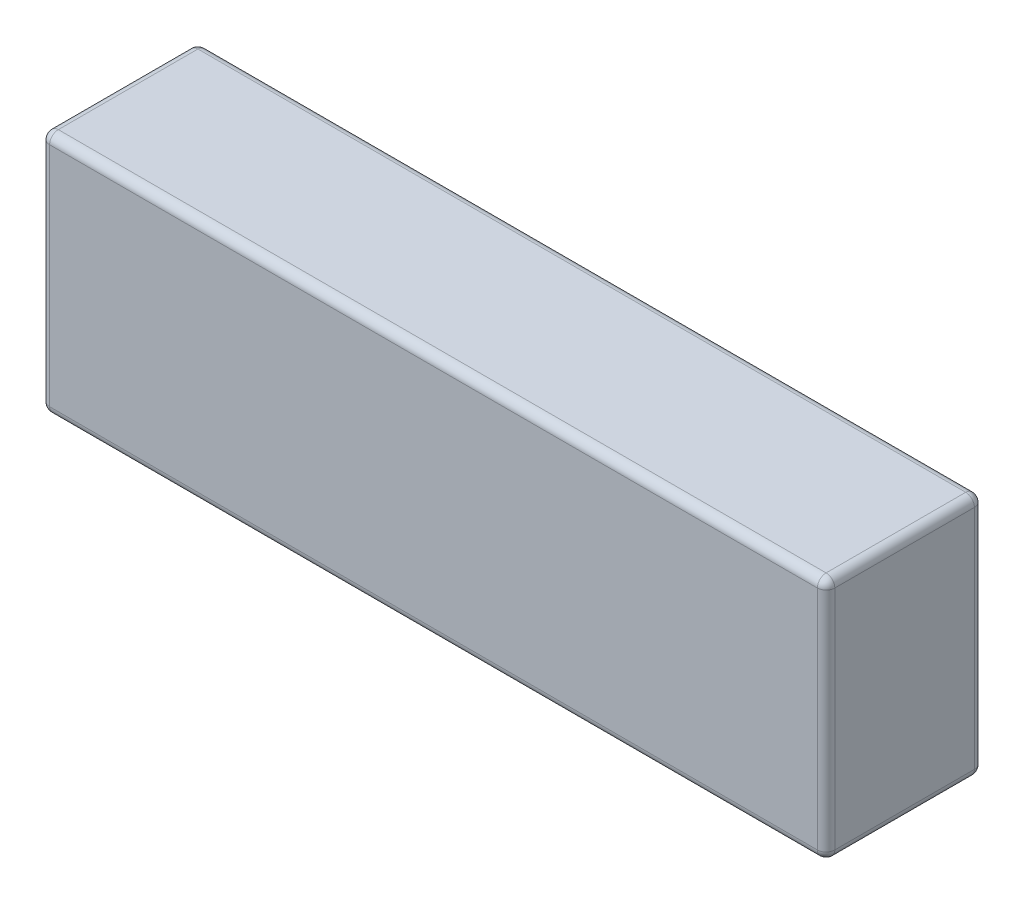
ISO-10303-21;
HEADER;
FILE_DESCRIPTION(('STEP AP214'),'2;1');
FILE_NAME('part.step','',(''),(''),'','','');
FILE_SCHEMA(('AUTOMOTIVE_DESIGN { 1 0 10303 214 1 1 1 1 }'));
ENDSEC;
DATA;
#1=APPLICATION_CONTEXT('core data for automotive mechanical design processes');
#2=APPLICATION_PROTOCOL_DEFINITION('international standard','automotive_design',2000,#1);
#3=PRODUCT_CONTEXT('',#1,'mechanical');
#4=PRODUCT('Part','Part','',(#3));
#5=PRODUCT_RELATED_PRODUCT_CATEGORY('part','',(#4));
#6=PRODUCT_DEFINITION_FORMATION('','',#4);
#7=PRODUCT_DEFINITION_CONTEXT('part definition',#1,'design');
#8=PRODUCT_DEFINITION('design','',#6,#7);
#9=PRODUCT_DEFINITION_SHAPE('','',#8);
#10=(LENGTH_UNIT() NAMED_UNIT(*) SI_UNIT(.MILLI.,.METRE.));
#11=(NAMED_UNIT(*) PLANE_ANGLE_UNIT() SI_UNIT($,.RADIAN.));
#12=(NAMED_UNIT(*) SI_UNIT($,.STERADIAN.) SOLID_ANGLE_UNIT());
#13=UNCERTAINTY_MEASURE_WITH_UNIT(LENGTH_MEASURE(1.E-05),#10,'distance_accuracy_value','');
#14=(GEOMETRIC_REPRESENTATION_CONTEXT(3) GLOBAL_UNCERTAINTY_ASSIGNED_CONTEXT((#13)) GLOBAL_UNIT_ASSIGNED_CONTEXT((#10,
#11,#12)) REPRESENTATION_CONTEXT('',''));
#15=CARTESIAN_POINT('',(0.,0.,0.));
#16=DIRECTION('',(0.,0.,1.));
#17=DIRECTION('',(1.,0.,0.));
#18=AXIS2_PLACEMENT_3D('',#15,#16,#17);
#19=CARTESIAN_POINT('',(-45.,28.,-9.));
#20=DIRECTION('',(1.,0.,0.));
#21=DIRECTION('',(0.,0.,-1.));
#22=AXIS2_PLACEMENT_3D('',#19,#20,#21);
#23=PLANE('',#22);
#24=DIRECTION('',(0.,0.,1.));
#25=VECTOR('',#24,1.);
#26=CARTESIAN_POINT('',(-45.,27.,-9.));
#27=LINE('',#26,#25);
#28=CARTESIAN_POINT('',(-45.,27.,8.));
#29=VERTEX_POINT('',#28);
#30=CARTESIAN_POINT('',(-45.,27.,-8.));
#31=VERTEX_POINT('',#30);
#32=EDGE_CURVE('E152',#29,#31,#27,.F.);
#33=ORIENTED_EDGE('',*,*,#32,.T.);
#34=DIRECTION('',(0.,-1.,0.));
#35=VECTOR('',#34,1.);
#36=CARTESIAN_POINT('',(-45.,28.,-8.));
#37=LINE('',#36,#35);
#38=CARTESIAN_POINT('',(-45.,1.,-8.));
#39=VERTEX_POINT('',#38);
#40=EDGE_CURVE('E155',#31,#39,#37,.T.);
#41=ORIENTED_EDGE('',*,*,#40,.T.);
#42=DIRECTION('',(0.,0.,1.));
#43=VECTOR('',#42,1.);
#44=CARTESIAN_POINT('',(-45.,1.,-9.));
#45=LINE('',#44,#43);
#46=CARTESIAN_POINT('',(-45.,1.,8.));
#47=VERTEX_POINT('',#46);
#48=EDGE_CURVE('E128',#39,#47,#45,.T.);
#49=ORIENTED_EDGE('',*,*,#48,.T.);
#50=DIRECTION('',(0.,-1.,0.));
#51=VECTOR('',#50,1.);
#52=CARTESIAN_POINT('',(-45.,28.,8.));
#53=LINE('',#52,#51);
#54=EDGE_CURVE('E146',#47,#29,#53,.F.);
#55=ORIENTED_EDGE('',*,*,#54,.T.);
#56=EDGE_LOOP('',(#33,#41,#49,#55));
#57=FACE_BOUND('',#56,.T.);
#58=ADVANCED_FACE('F34',(#57),#23,.F.);
#59=CARTESIAN_POINT('',(-45.,28.,9.));
#60=DIRECTION('',(0.,0.,-1.));
#61=DIRECTION('',(-1.,0.,0.));
#62=AXIS2_PLACEMENT_3D('',#59,#60,#61);
#63=PLANE('',#62);
#64=DIRECTION('',(1.,0.,0.));
#65=VECTOR('',#64,1.);
#66=CARTESIAN_POINT('',(-45.,27.,9.));
#67=LINE('',#66,#65);
#68=CARTESIAN_POINT('',(44.,27.,9.));
#69=VERTEX_POINT('',#68);
#70=CARTESIAN_POINT('',(-44.,27.,9.));
#71=VERTEX_POINT('',#70);
#72=EDGE_CURVE('E43',#69,#71,#67,.F.);
#73=ORIENTED_EDGE('',*,*,#72,.T.);
#74=DIRECTION('',(0.,-1.,0.));
#75=VECTOR('',#74,1.);
#76=CARTESIAN_POINT('',(-44.,28.,9.));
#77=LINE('',#76,#75);
#78=CARTESIAN_POINT('',(-44.,1.,9.));
#79=VERTEX_POINT('',#78);
#80=EDGE_CURVE('E11',#71,#79,#77,.T.);
#81=ORIENTED_EDGE('',*,*,#80,.T.);
#82=DIRECTION('',(1.,0.,0.));
#83=VECTOR('',#82,1.);
#84=CARTESIAN_POINT('',(-45.,1.,9.));
#85=LINE('',#84,#83);
#86=CARTESIAN_POINT('',(44.,1.,9.));
#87=VERTEX_POINT('',#86);
#88=EDGE_CURVE('E195',#79,#87,#85,.T.);
#89=ORIENTED_EDGE('',*,*,#88,.T.);
#90=DIRECTION('',(0.,-1.,0.));
#91=VECTOR('',#90,1.);
#92=CARTESIAN_POINT('',(44.,28.,9.));
#93=LINE('',#92,#91);
#94=EDGE_CURVE('E54',#87,#69,#93,.F.);
#95=ORIENTED_EDGE('',*,*,#94,.T.);
#96=EDGE_LOOP('',(#73,#81,#89,#95));
#97=FACE_BOUND('',#96,.T.);
#98=ADVANCED_FACE('F327',(#97),#63,.F.);
#99=CARTESIAN_POINT('',(45.,28.,-9.));
#100=DIRECTION('',(-1.,0.,0.));
#101=DIRECTION('',(0.,0.,1.));
#102=AXIS2_PLACEMENT_3D('',#99,#100,#101);
#103=PLANE('',#102);
#104=DIRECTION('',(0.,0.,-1.));
#105=VECTOR('',#104,1.);
#106=CARTESIAN_POINT('',(45.,1.,-9.));
#107=LINE('',#106,#105);
#108=CARTESIAN_POINT('',(45.,1.,8.));
#109=VERTEX_POINT('',#108);
#110=CARTESIAN_POINT('',(45.,1.,-8.));
#111=VERTEX_POINT('',#110);
#112=EDGE_CURVE('E172',#109,#111,#107,.T.);
#113=ORIENTED_EDGE('',*,*,#112,.T.);
#114=DIRECTION('',(0.,-1.,0.));
#115=VECTOR('',#114,1.);
#116=CARTESIAN_POINT('',(45.,28.,-8.));
#117=LINE('',#116,#115);
#118=CARTESIAN_POINT('',(45.,27.,-8.));
#119=VERTEX_POINT('',#118);
#120=EDGE_CURVE('E175',#111,#119,#117,.F.);
#121=ORIENTED_EDGE('',*,*,#120,.T.);
#122=DIRECTION('',(0.,0.,-1.));
#123=VECTOR('',#122,1.);
#124=CARTESIAN_POINT('',(45.,27.,9.));
#125=LINE('',#124,#123);
#126=CARTESIAN_POINT('',(45.,27.,8.));
#127=VERTEX_POINT('',#126);
#128=EDGE_CURVE('E170',#119,#127,#125,.F.);
#129=ORIENTED_EDGE('',*,*,#128,.T.);
#130=DIRECTION('',(0.,-1.,0.));
#131=VECTOR('',#130,1.);
#132=CARTESIAN_POINT('',(45.,28.,8.));
#133=LINE('',#132,#131);
#134=EDGE_CURVE('E168',#127,#109,#133,.T.);
#135=ORIENTED_EDGE('',*,*,#134,.T.);
#136=EDGE_LOOP('',(#113,#121,#129,#135));
#137=FACE_BOUND('',#136,.T.);
#138=ADVANCED_FACE('F296',(#137),#103,.F.);
#139=CARTESIAN_POINT('',(-45.,28.,-9.));
#140=DIRECTION('',(0.,0.,1.));
#141=DIRECTION('',(1.,0.,0.));
#142=AXIS2_PLACEMENT_3D('',#139,#140,#141);
#143=PLANE('',#142);
#144=DIRECTION('',(-1.,0.,0.));
#145=VECTOR('',#144,1.);
#146=CARTESIAN_POINT('',(45.,27.,-9.));
#147=LINE('',#146,#145);
#148=CARTESIAN_POINT('',(-44.,27.,-9.));
#149=VERTEX_POINT('',#148);
#150=CARTESIAN_POINT('',(44.,27.,-9.));
#151=VERTEX_POINT('',#150);
#152=EDGE_CURVE('E190',#149,#151,#147,.F.);
#153=ORIENTED_EDGE('',*,*,#152,.T.);
#154=DIRECTION('',(0.,-1.,0.));
#155=VECTOR('',#154,1.);
#156=CARTESIAN_POINT('',(44.,28.,-9.));
#157=LINE('',#156,#155);
#158=CARTESIAN_POINT('',(44.,1.,-9.));
#159=VERTEX_POINT('',#158);
#160=EDGE_CURVE('E192',#151,#159,#157,.T.);
#161=ORIENTED_EDGE('',*,*,#160,.T.);
#162=DIRECTION('',(-1.,0.,0.));
#163=VECTOR('',#162,1.);
#164=CARTESIAN_POINT('',(-45.,1.,-9.));
#165=LINE('',#164,#163);
#166=CARTESIAN_POINT('',(-44.,1.,-9.));
#167=VERTEX_POINT('',#166);
#168=EDGE_CURVE('E186',#159,#167,#165,.T.);
#169=ORIENTED_EDGE('',*,*,#168,.T.);
#170=DIRECTION('',(0.,-1.,0.));
#171=VECTOR('',#170,1.);
#172=CARTESIAN_POINT('',(-44.,28.,-9.));
#173=LINE('',#172,#171);
#174=EDGE_CURVE('E188',#167,#149,#173,.F.);
#175=ORIENTED_EDGE('',*,*,#174,.T.);
#176=EDGE_LOOP('',(#153,#161,#169,#175));
#177=FACE_BOUND('',#176,.T.);
#178=ADVANCED_FACE('F270',(#177),#143,.F.);
#179=CARTESIAN_POINT('',(0.,28.,0.));
#180=DIRECTION('',(0.,1.,0.));
#181=DIRECTION('',(0.,0.,1.));
#182=AXIS2_PLACEMENT_3D('',#179,#180,#181);
#183=PLANE('',#182);
#184=DIRECTION('',(0.,0.,-1.));
#185=VECTOR('',#184,1.);
#186=CARTESIAN_POINT('',(44.,28.,-9.));
#187=LINE('',#186,#185);
#188=CARTESIAN_POINT('',(44.,28.,8.));
#189=VERTEX_POINT('',#188);
#190=CARTESIAN_POINT('',(44.,28.,-8.));
#191=VERTEX_POINT('',#190);
#192=EDGE_CURVE('E181',#189,#191,#187,.T.);
#193=ORIENTED_EDGE('',*,*,#192,.T.);
#194=DIRECTION('',(-1.,0.,0.));
#195=VECTOR('',#194,1.);
#196=CARTESIAN_POINT('',(-45.,28.,-8.));
#197=LINE('',#196,#195);
#198=CARTESIAN_POINT('',(-44.,28.,-8.));
#199=VERTEX_POINT('',#198);
#200=EDGE_CURVE('E184',#191,#199,#197,.T.);
#201=ORIENTED_EDGE('',*,*,#200,.T.);
#202=DIRECTION('',(0.,0.,1.));
#203=VECTOR('',#202,1.);
#204=CARTESIAN_POINT('',(-44.,28.,9.));
#205=LINE('',#204,#203);
#206=CARTESIAN_POINT('',(-44.,28.,8.));
#207=VERTEX_POINT('',#206);
#208=EDGE_CURVE('E179',#199,#207,#205,.T.);
#209=ORIENTED_EDGE('',*,*,#208,.T.);
#210=DIRECTION('',(1.,0.,0.));
#211=VECTOR('',#210,1.);
#212=CARTESIAN_POINT('',(45.,28.,8.));
#213=LINE('',#212,#211);
#214=EDGE_CURVE('E177',#207,#189,#213,.T.);
#215=ORIENTED_EDGE('',*,*,#214,.T.);
#216=EDGE_LOOP('',(#193,#201,#209,#215));
#217=FACE_BOUND('',#216,.T.);
#218=ADVANCED_FACE('F278',(#217),#183,.T.);
#219=CARTESIAN_POINT('',(0.,0.,0.));
#220=DIRECTION('',(0.,1.,0.));
#221=DIRECTION('',(0.,0.,1.));
#222=AXIS2_PLACEMENT_3D('',#219,#220,#221);
#223=PLANE('',#222);
#224=DIRECTION('',(0.,0.,1.));
#225=VECTOR('',#224,1.);
#226=CARTESIAN_POINT('',(-44.,0.,0.));
#227=LINE('',#226,#225);
#228=CARTESIAN_POINT('',(-44.,0.,8.));
#229=VERTEX_POINT('',#228);
#230=CARTESIAN_POINT('',(-44.,0.,-8.));
#231=VERTEX_POINT('',#230);
#232=EDGE_CURVE('E130',#229,#231,#227,.F.);
#233=ORIENTED_EDGE('',*,*,#232,.T.);
#234=DIRECTION('',(-1.,0.,0.));
#235=VECTOR('',#234,1.);
#236=CARTESIAN_POINT('',(0.,0.,-8.));
#237=LINE('',#236,#235);
#238=CARTESIAN_POINT('',(44.,0.,-8.));
#239=VERTEX_POINT('',#238);
#240=EDGE_CURVE('E166',#231,#239,#237,.F.);
#241=ORIENTED_EDGE('',*,*,#240,.T.);
#242=DIRECTION('',(0.,0.,-1.));
#243=VECTOR('',#242,1.);
#244=CARTESIAN_POINT('',(44.,0.,0.));
#245=LINE('',#244,#243);
#246=CARTESIAN_POINT('',(44.,0.,8.));
#247=VERTEX_POINT('',#246);
#248=EDGE_CURVE('E163',#239,#247,#245,.F.);
#249=ORIENTED_EDGE('',*,*,#248,.T.);
#250=DIRECTION('',(1.,0.,0.));
#251=VECTOR('',#250,1.);
#252=CARTESIAN_POINT('',(0.,0.,8.));
#253=LINE('',#252,#251);
#254=EDGE_CURVE('E158',#247,#229,#253,.F.);
#255=ORIENTED_EDGE('',*,*,#254,.T.);
#256=EDGE_LOOP('',(#233,#241,#249,#255));
#257=FACE_BOUND('',#256,.T.);
#258=ADVANCED_FACE('F357',(#257),#223,.F.);
#259=CARTESIAN_POINT('',(44.,27.,0.));
#260=DIRECTION('',(0.,0.,1.));
#261=DIRECTION('',(1.,0.,0.));
#262=AXIS2_PLACEMENT_3D('',#259,#260,#261);
#263=CYLINDRICAL_SURFACE('',#262,1.);
#264=CARTESIAN_POINT('',(44.,27.,-8.));
#265=DIRECTION('',(0.,0.,-1.));
#266=DIRECTION('',(-1.,0.,0.));
#267=AXIS2_PLACEMENT_3D('',#264,#265,#266);
#268=CIRCLE('',#267,1.);
#269=EDGE_CURVE('E38',#191,#119,#268,.T.);
#270=ORIENTED_EDGE('',*,*,#269,.F.);
#271=ORIENTED_EDGE('',*,*,#192,.F.);
#272=CARTESIAN_POINT('',(44.,27.,8.));
#273=DIRECTION('',(0.,0.,1.));
#274=DIRECTION('',(0.,-1.,0.));
#275=AXIS2_PLACEMENT_3D('',#272,#273,#274);
#276=CIRCLE('',#275,1.);
#277=EDGE_CURVE('E249',#127,#189,#276,.T.);
#278=ORIENTED_EDGE('',*,*,#277,.F.);
#279=ORIENTED_EDGE('',*,*,#128,.F.);
#280=EDGE_LOOP('',(#270,#271,#278,#279));
#281=FACE_BOUND('',#280,.T.);
#282=ADVANCED_FACE('F36',(#281),#263,.T.);
#283=CARTESIAN_POINT('',(44.,27.,-8.));
#284=DIRECTION('',(0.,0.,1.));
#285=DIRECTION('',(1.,0.,0.));
#286=AXIS2_PLACEMENT_3D('',#283,#284,#285);
#287=SPHERICAL_SURFACE('',#286,1.);
#288=CARTESIAN_POINT('',(44.,27.,-8.));
#289=DIRECTION('',(1.,0.,0.));
#290=DIRECTION('',(0.,0.,-1.));
#291=AXIS2_PLACEMENT_3D('',#288,#289,#290);
#292=CIRCLE('',#291,1.);
#293=EDGE_CURVE('E244',#191,#151,#292,.F.);
#294=ORIENTED_EDGE('',*,*,#293,.F.);
#295=ORIENTED_EDGE('',*,*,#269,.T.);
#296=CARTESIAN_POINT('',(44.,27.,-8.));
#297=DIRECTION('',(0.,1.,0.));
#298=DIRECTION('',(0.,0.,1.));
#299=AXIS2_PLACEMENT_3D('',#296,#297,#298);
#300=CIRCLE('',#299,1.);
#301=EDGE_CURVE('E247',#151,#119,#300,.F.);
#302=ORIENTED_EDGE('',*,*,#301,.F.);
#303=EDGE_LOOP('',(#294,#295,#302));
#304=FACE_BOUND('',#303,.T.);
#305=ADVANCED_FACE('F260',(#304),#287,.T.);
#306=CARTESIAN_POINT('',(44.,27.,8.));
#307=DIRECTION('',(0.,0.,1.));
#308=DIRECTION('',(1.,0.,0.));
#309=AXIS2_PLACEMENT_3D('',#306,#307,#308);
#310=SPHERICAL_SURFACE('',#309,1.);
#311=CARTESIAN_POINT('',(44.,27.,8.));
#312=DIRECTION('',(0.,1.,0.));
#313=DIRECTION('',(0.,0.,1.));
#314=AXIS2_PLACEMENT_3D('',#311,#312,#313);
#315=CIRCLE('',#314,1.);
#316=EDGE_CURVE('E239',#127,#69,#315,.F.);
#317=ORIENTED_EDGE('',*,*,#316,.F.);
#318=ORIENTED_EDGE('',*,*,#277,.T.);
#319=CARTESIAN_POINT('',(44.,27.,8.));
#320=DIRECTION('',(1.,0.,0.));
#321=DIRECTION('',(0.,0.,-1.));
#322=AXIS2_PLACEMENT_3D('',#319,#320,#321);
#323=CIRCLE('',#322,1.);
#324=EDGE_CURVE('E241',#69,#189,#323,.F.);
#325=ORIENTED_EDGE('',*,*,#324,.F.);
#326=EDGE_LOOP('',(#317,#318,#325));
#327=FACE_BOUND('',#326,.T.);
#328=ADVANCED_FACE('F290',(#327),#310,.T.);
#329=CARTESIAN_POINT('',(44.,28.,-8.));
#330=DIRECTION('',(0.,-1.,0.));
#331=DIRECTION('',(0.,0.,-1.));
#332=AXIS2_PLACEMENT_3D('',#329,#330,#331);
#333=CYLINDRICAL_SURFACE('',#332,1.);
#334=ORIENTED_EDGE('',*,*,#301,.T.);
#335=ORIENTED_EDGE('',*,*,#120,.F.);
#336=CARTESIAN_POINT('',(44.,1.,-8.));
#337=DIRECTION('',(0.,-1.,0.));
#338=DIRECTION('',(0.,0.,-1.));
#339=AXIS2_PLACEMENT_3D('',#336,#337,#338);
#340=CIRCLE('',#339,1.);
#341=EDGE_CURVE('E234',#159,#111,#340,.T.);
#342=ORIENTED_EDGE('',*,*,#341,.F.);
#343=ORIENTED_EDGE('',*,*,#160,.F.);
#344=EDGE_LOOP('',(#334,#335,#342,#343));
#345=FACE_BOUND('',#344,.T.);
#346=ADVANCED_FACE('F267',(#345),#333,.T.);
#347=CARTESIAN_POINT('',(0.,27.,-8.));
#348=DIRECTION('',(1.,0.,0.));
#349=DIRECTION('',(0.,0.,-1.));
#350=AXIS2_PLACEMENT_3D('',#347,#348,#349);
#351=CYLINDRICAL_SURFACE('',#350,1.);
#352=ORIENTED_EDGE('',*,*,#293,.T.);
#353=ORIENTED_EDGE('',*,*,#152,.F.);
#354=CARTESIAN_POINT('',(-44.,27.,-8.));
#355=DIRECTION('',(-1.,0.,0.));
#356=DIRECTION('',(0.,0.,1.));
#357=AXIS2_PLACEMENT_3D('',#354,#355,#356);
#358=CIRCLE('',#357,1.);
#359=EDGE_CURVE('E231',#199,#149,#358,.T.);
#360=ORIENTED_EDGE('',*,*,#359,.F.);
#361=ORIENTED_EDGE('',*,*,#200,.F.);
#362=EDGE_LOOP('',(#352,#353,#360,#361));
#363=FACE_BOUND('',#362,.T.);
#364=ADVANCED_FACE('F275',(#363),#351,.T.);
#365=CARTESIAN_POINT('',(-44.,27.,0.));
#366=DIRECTION('',(0.,0.,-1.));
#367=DIRECTION('',(-1.,0.,0.));
#368=AXIS2_PLACEMENT_3D('',#365,#366,#367);
#369=CYLINDRICAL_SURFACE('',#368,1.);
#370=CARTESIAN_POINT('',(-44.,27.,8.));
#371=DIRECTION('',(0.,0.,1.));
#372=DIRECTION('',(1.,0.,0.));
#373=AXIS2_PLACEMENT_3D('',#370,#371,#372);
#374=CIRCLE('',#373,1.);
#375=EDGE_CURVE('E225',#207,#29,#374,.T.);
#376=ORIENTED_EDGE('',*,*,#375,.F.);
#377=ORIENTED_EDGE('',*,*,#208,.F.);
#378=CARTESIAN_POINT('',(-44.,27.,-8.));
#379=DIRECTION('',(0.,0.,-1.));
#380=DIRECTION('',(-1.,0.,0.));
#381=AXIS2_PLACEMENT_3D('',#378,#379,#380);
#382=CIRCLE('',#381,1.);
#383=EDGE_CURVE('E228',#31,#199,#382,.T.);
#384=ORIENTED_EDGE('',*,*,#383,.F.);
#385=ORIENTED_EDGE('',*,*,#32,.F.);
#386=EDGE_LOOP('',(#376,#377,#384,#385));
#387=FACE_BOUND('',#386,.T.);
#388=ADVANCED_FACE('F283',(#387),#369,.T.);
#389=CARTESIAN_POINT('',(0.,27.,8.));
#390=DIRECTION('',(-1.,0.,0.));
#391=DIRECTION('',(0.,0.,1.));
#392=AXIS2_PLACEMENT_3D('',#389,#390,#391);
#393=CYLINDRICAL_SURFACE('',#392,1.);
#394=ORIENTED_EDGE('',*,*,#324,.T.);
#395=ORIENTED_EDGE('',*,*,#214,.F.);
#396=CARTESIAN_POINT('',(-44.,27.,8.));
#397=DIRECTION('',(-1.,0.,0.));
#398=DIRECTION('',(0.,0.,1.));
#399=AXIS2_PLACEMENT_3D('',#396,#397,#398);
#400=CIRCLE('',#399,1.);
#401=EDGE_CURVE('E222',#71,#207,#400,.T.);
#402=ORIENTED_EDGE('',*,*,#401,.F.);
#403=ORIENTED_EDGE('',*,*,#72,.F.);
#404=EDGE_LOOP('',(#394,#395,#402,#403));
#405=FACE_BOUND('',#404,.T.);
#406=ADVANCED_FACE('F288',(#405),#393,.T.);
#407=CARTESIAN_POINT('',(44.,28.,8.));
#408=DIRECTION('',(0.,-1.,0.));
#409=DIRECTION('',(0.,0.,-1.));
#410=AXIS2_PLACEMENT_3D('',#407,#408,#409);
#411=CYLINDRICAL_SURFACE('',#410,1.);
#412=ORIENTED_EDGE('',*,*,#316,.T.);
#413=ORIENTED_EDGE('',*,*,#94,.F.);
#414=CARTESIAN_POINT('',(44.,1.,8.));
#415=DIRECTION('',(0.,-1.,0.));
#416=DIRECTION('',(0.,0.,-1.));
#417=AXIS2_PLACEMENT_3D('',#414,#415,#416);
#418=CIRCLE('',#417,1.);
#419=EDGE_CURVE('E219',#109,#87,#418,.T.);
#420=ORIENTED_EDGE('',*,*,#419,.F.);
#421=ORIENTED_EDGE('',*,*,#134,.F.);
#422=EDGE_LOOP('',(#412,#413,#420,#421));
#423=FACE_BOUND('',#422,.T.);
#424=ADVANCED_FACE('F293',(#423),#411,.T.);
#425=CARTESIAN_POINT('',(44.,1.,-9.));
#426=DIRECTION('',(0.,0.,-1.));
#427=DIRECTION('',(-1.,0.,0.));
#428=AXIS2_PLACEMENT_3D('',#425,#426,#427);
#429=CYLINDRICAL_SURFACE('',#428,1.);
#430=CARTESIAN_POINT('',(44.,1.,-8.));
#431=DIRECTION('',(0.,0.,-1.));
#432=DIRECTION('',(-1.,0.,0.));
#433=AXIS2_PLACEMENT_3D('',#430,#431,#432);
#434=CIRCLE('',#433,1.);
#435=EDGE_CURVE('E236',#111,#239,#434,.T.);
#436=ORIENTED_EDGE('',*,*,#435,.F.);
#437=ORIENTED_EDGE('',*,*,#112,.F.);
#438=CARTESIAN_POINT('',(44.,1.,8.));
#439=DIRECTION('',(0.,0.,1.));
#440=DIRECTION('',(1.,0.,0.));
#441=AXIS2_PLACEMENT_3D('',#438,#439,#440);
#442=CIRCLE('',#441,1.);
#443=EDGE_CURVE('E216',#247,#109,#442,.T.);
#444=ORIENTED_EDGE('',*,*,#443,.F.);
#445=ORIENTED_EDGE('',*,*,#248,.F.);
#446=EDGE_LOOP('',(#436,#437,#444,#445));
#447=FACE_BOUND('',#446,.T.);
#448=ADVANCED_FACE('F300',(#447),#429,.T.);
#449=CARTESIAN_POINT('',(44.,1.,-8.));
#450=DIRECTION('',(0.,0.,1.));
#451=DIRECTION('',(1.,0.,0.));
#452=AXIS2_PLACEMENT_3D('',#449,#450,#451);
#453=SPHERICAL_SURFACE('',#452,1.);
#454=ORIENTED_EDGE('',*,*,#341,.T.);
#455=ORIENTED_EDGE('',*,*,#435,.T.);
#456=CARTESIAN_POINT('',(44.,1.,-8.));
#457=DIRECTION('',(1.,0.,0.));
#458=DIRECTION('',(0.,0.,-1.));
#459=AXIS2_PLACEMENT_3D('',#456,#457,#458);
#460=CIRCLE('',#459,1.);
#461=EDGE_CURVE('E213',#159,#239,#460,.F.);
#462=ORIENTED_EDGE('',*,*,#461,.F.);
#463=EDGE_LOOP('',(#454,#455,#462));
#464=FACE_BOUND('',#463,.T.);
#465=ADVANCED_FACE('F305',(#464),#453,.T.);
#466=CARTESIAN_POINT('',(-44.,27.,-8.));
#467=DIRECTION('',(0.,0.,1.));
#468=DIRECTION('',(1.,0.,0.));
#469=AXIS2_PLACEMENT_3D('',#466,#467,#468);
#470=SPHERICAL_SURFACE('',#469,1.);
#471=ORIENTED_EDGE('',*,*,#383,.T.);
#472=ORIENTED_EDGE('',*,*,#359,.T.);
#473=CARTESIAN_POINT('',(-44.,27.,-8.));
#474=DIRECTION('',(0.,1.,0.));
#475=DIRECTION('',(0.,0.,1.));
#476=AXIS2_PLACEMENT_3D('',#473,#474,#475);
#477=CIRCLE('',#476,1.);
#478=EDGE_CURVE('E210',#31,#149,#477,.F.);
#479=ORIENTED_EDGE('',*,*,#478,.F.);
#480=EDGE_LOOP('',(#471,#472,#479));
#481=FACE_BOUND('',#480,.T.);
#482=ADVANCED_FACE('F316',(#481),#470,.T.);
#483=CARTESIAN_POINT('',(-44.,27.,8.));
#484=DIRECTION('',(0.,0.,1.));
#485=DIRECTION('',(1.,0.,0.));
#486=AXIS2_PLACEMENT_3D('',#483,#484,#485);
#487=SPHERICAL_SURFACE('',#486,1.);
#488=ORIENTED_EDGE('',*,*,#401,.T.);
#489=ORIENTED_EDGE('',*,*,#375,.T.);
#490=CARTESIAN_POINT('',(-44.,27.,8.));
#491=DIRECTION('',(0.,1.,0.));
#492=DIRECTION('',(0.,0.,1.));
#493=AXIS2_PLACEMENT_3D('',#490,#491,#492);
#494=CIRCLE('',#493,1.);
#495=EDGE_CURVE('E149',#71,#29,#494,.F.);
#496=ORIENTED_EDGE('',*,*,#495,.F.);
#497=EDGE_LOOP('',(#488,#489,#496));
#498=FACE_BOUND('',#497,.T.);
#499=ADVANCED_FACE('F286',(#498),#487,.T.);
#500=CARTESIAN_POINT('',(44.,1.,8.));
#501=DIRECTION('',(0.,0.,1.));
#502=DIRECTION('',(1.,0.,0.));
#503=AXIS2_PLACEMENT_3D('',#500,#501,#502);
#504=SPHERICAL_SURFACE('',#503,1.);
#505=ORIENTED_EDGE('',*,*,#443,.T.);
#506=ORIENTED_EDGE('',*,*,#419,.T.);
#507=CARTESIAN_POINT('',(44.,1.,8.));
#508=DIRECTION('',(1.,0.,0.));
#509=DIRECTION('',(0.,0.,-1.));
#510=AXIS2_PLACEMENT_3D('',#507,#508,#509);
#511=CIRCLE('',#510,1.);
#512=EDGE_CURVE('E206',#247,#87,#511,.F.);
#513=ORIENTED_EDGE('',*,*,#512,.F.);
#514=EDGE_LOOP('',(#505,#506,#513));
#515=FACE_BOUND('',#514,.T.);
#516=ADVANCED_FACE('F323',(#515),#504,.T.);
#517=CARTESIAN_POINT('',(-45.,1.,-8.));
#518=DIRECTION('',(-1.,0.,0.));
#519=DIRECTION('',(0.,0.,1.));
#520=AXIS2_PLACEMENT_3D('',#517,#518,#519);
#521=CYLINDRICAL_SURFACE('',#520,1.);
#522=ORIENTED_EDGE('',*,*,#461,.T.);
#523=ORIENTED_EDGE('',*,*,#240,.F.);
#524=CARTESIAN_POINT('',(-44.,1.,-8.));
#525=DIRECTION('',(-1.,0.,0.));
#526=DIRECTION('',(0.,0.,1.));
#527=AXIS2_PLACEMENT_3D('',#524,#525,#526);
#528=CIRCLE('',#527,1.);
#529=EDGE_CURVE('E203',#167,#231,#528,.T.);
#530=ORIENTED_EDGE('',*,*,#529,.F.);
#531=ORIENTED_EDGE('',*,*,#168,.F.);
#532=EDGE_LOOP('',(#522,#523,#530,#531));
#533=FACE_BOUND('',#532,.T.);
#534=ADVANCED_FACE('F308',(#533),#521,.T.);
#535=CARTESIAN_POINT('',(-44.,28.,-8.));
#536=DIRECTION('',(0.,-1.,0.));
#537=DIRECTION('',(0.,0.,-1.));
#538=AXIS2_PLACEMENT_3D('',#535,#536,#537);
#539=CYLINDRICAL_SURFACE('',#538,1.);
#540=ORIENTED_EDGE('',*,*,#478,.T.);
#541=ORIENTED_EDGE('',*,*,#174,.F.);
#542=CARTESIAN_POINT('',(-44.,1.,-8.));
#543=DIRECTION('',(0.,-1.,0.));
#544=DIRECTION('',(0.,0.,-1.));
#545=AXIS2_PLACEMENT_3D('',#542,#543,#544);
#546=CIRCLE('',#545,1.);
#547=EDGE_CURVE('E143',#39,#167,#546,.T.);
#548=ORIENTED_EDGE('',*,*,#547,.F.);
#549=ORIENTED_EDGE('',*,*,#40,.F.);
#550=EDGE_LOOP('',(#540,#541,#548,#549));
#551=FACE_BOUND('',#550,.T.);
#552=ADVANCED_FACE('F314',(#551),#539,.T.);
#553=CARTESIAN_POINT('',(-44.,28.,8.));
#554=DIRECTION('',(0.,-1.,0.));
#555=DIRECTION('',(0.,0.,-1.));
#556=AXIS2_PLACEMENT_3D('',#553,#554,#555);
#557=CYLINDRICAL_SURFACE('',#556,1.);
#558=ORIENTED_EDGE('',*,*,#495,.T.);
#559=ORIENTED_EDGE('',*,*,#54,.F.);
#560=CARTESIAN_POINT('',(-44.,1.,8.));
#561=DIRECTION('',(0.,-1.,0.));
#562=DIRECTION('',(0.,0.,-1.));
#563=AXIS2_PLACEMENT_3D('',#560,#561,#562);
#564=CIRCLE('',#563,1.);
#565=EDGE_CURVE('E135',#79,#47,#564,.T.);
#566=ORIENTED_EDGE('',*,*,#565,.F.);
#567=ORIENTED_EDGE('',*,*,#80,.F.);
#568=EDGE_LOOP('',(#558,#559,#566,#567));
#569=FACE_BOUND('',#568,.T.);
#570=ADVANCED_FACE('F147',(#569),#557,.T.);
#571=CARTESIAN_POINT('',(-45.,1.,8.));
#572=DIRECTION('',(1.,0.,0.));
#573=DIRECTION('',(0.,0.,-1.));
#574=AXIS2_PLACEMENT_3D('',#571,#572,#573);
#575=CYLINDRICAL_SURFACE('',#574,1.);
#576=ORIENTED_EDGE('',*,*,#512,.T.);
#577=ORIENTED_EDGE('',*,*,#88,.F.);
#578=CARTESIAN_POINT('',(-44.,1.,8.));
#579=DIRECTION('',(-1.,0.,0.));
#580=DIRECTION('',(0.,0.,1.));
#581=AXIS2_PLACEMENT_3D('',#578,#579,#580);
#582=CIRCLE('',#581,1.);
#583=EDGE_CURVE('E139',#229,#79,#582,.T.);
#584=ORIENTED_EDGE('',*,*,#583,.F.);
#585=ORIENTED_EDGE('',*,*,#254,.F.);
#586=EDGE_LOOP('',(#576,#577,#584,#585));
#587=FACE_BOUND('',#586,.T.);
#588=ADVANCED_FACE('F341',(#587),#575,.T.);
#589=CARTESIAN_POINT('',(-44.,1.,-8.));
#590=DIRECTION('',(0.,0.,1.));
#591=DIRECTION('',(1.,0.,0.));
#592=AXIS2_PLACEMENT_3D('',#589,#590,#591);
#593=SPHERICAL_SURFACE('',#592,1.);
#594=ORIENTED_EDGE('',*,*,#547,.T.);
#595=ORIENTED_EDGE('',*,*,#529,.T.);
#596=CARTESIAN_POINT('',(-44.,1.,-8.));
#597=DIRECTION('',(0.,0.,-1.));
#598=DIRECTION('',(-1.,0.,0.));
#599=AXIS2_PLACEMENT_3D('',#596,#597,#598);
#600=CIRCLE('',#599,1.);
#601=EDGE_CURVE('E132',#39,#231,#600,.F.);
#602=ORIENTED_EDGE('',*,*,#601,.F.);
#603=EDGE_LOOP('',(#594,#595,#602));
#604=FACE_BOUND('',#603,.T.);
#605=ADVANCED_FACE('F312',(#604),#593,.T.);
#606=CARTESIAN_POINT('',(-44.,1.,8.));
#607=DIRECTION('',(0.,0.,1.));
#608=DIRECTION('',(1.,0.,0.));
#609=AXIS2_PLACEMENT_3D('',#606,#607,#608);
#610=SPHERICAL_SURFACE('',#609,1.);
#611=ORIENTED_EDGE('',*,*,#583,.T.);
#612=ORIENTED_EDGE('',*,*,#565,.T.);
#613=CARTESIAN_POINT('',(-44.,1.,8.));
#614=DIRECTION('',(0.,0.,1.));
#615=DIRECTION('',(1.,0.,0.));
#616=AXIS2_PLACEMENT_3D('',#613,#614,#615);
#617=CIRCLE('',#616,1.);
#618=EDGE_CURVE('E124',#229,#47,#617,.F.);
#619=ORIENTED_EDGE('',*,*,#618,.F.);
#620=EDGE_LOOP('',(#611,#612,#619));
#621=FACE_BOUND('',#620,.T.);
#622=ADVANCED_FACE('F137',(#621),#610,.T.);
#623=CARTESIAN_POINT('',(-44.,1.,-9.));
#624=DIRECTION('',(0.,0.,1.));
#625=DIRECTION('',(1.,0.,0.));
#626=AXIS2_PLACEMENT_3D('',#623,#624,#625);
#627=CYLINDRICAL_SURFACE('',#626,1.);
#628=ORIENTED_EDGE('',*,*,#601,.T.);
#629=ORIENTED_EDGE('',*,*,#232,.F.);
#630=ORIENTED_EDGE('',*,*,#618,.T.);
#631=ORIENTED_EDGE('',*,*,#48,.F.);
#632=EDGE_LOOP('',(#628,#629,#630,#631));
#633=FACE_BOUND('',#632,.T.);
#634=ADVANCED_FACE('F126',(#633),#627,.T.);
#635=CLOSED_SHELL('',(#58,#98,#138,#178,#218,#258,#282,#305,#328,#346,#364,#388,#406,#424,#448,
#465,#482,#499,#516,#534,#552,#570,#588,#605,#622,#634));
#636=MANIFOLD_SOLID_BREP('B2',#635);
#637=ADVANCED_BREP_SHAPE_REPRESENTATION('',(#18,#636),#14);
#638=SHAPE_DEFINITION_REPRESENTATION(#9,#637);
ENDSEC;
END-ISO-10303-21;
